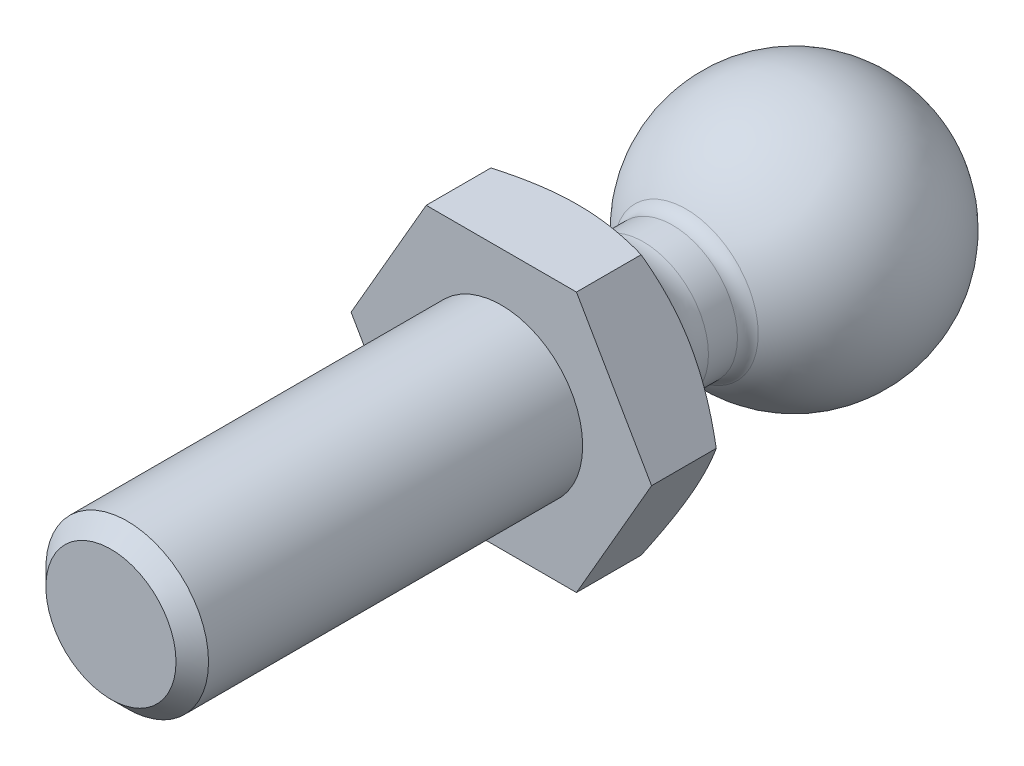
ISO-10303-21;
HEADER;
FILE_DESCRIPTION(('STEP AP214'),'2;1');
FILE_NAME('part.step','',(''),(''),'','','');
FILE_SCHEMA(('AUTOMOTIVE_DESIGN { 1 0 10303 214 1 1 1 1 }'));
ENDSEC;
DATA;
#1=APPLICATION_CONTEXT('core data for automotive mechanical design processes');
#2=APPLICATION_PROTOCOL_DEFINITION('international standard','automotive_design',2000,#1);
#3=PRODUCT_CONTEXT('',#1,'mechanical');
#4=PRODUCT('Part','Part','',(#3));
#5=PRODUCT_RELATED_PRODUCT_CATEGORY('part','',(#4));
#6=PRODUCT_DEFINITION_FORMATION('','',#4);
#7=PRODUCT_DEFINITION_CONTEXT('part definition',#1,'design');
#8=PRODUCT_DEFINITION('design','',#6,#7);
#9=PRODUCT_DEFINITION_SHAPE('','',#8);
#10=(LENGTH_UNIT() NAMED_UNIT(*) SI_UNIT(.MILLI.,.METRE.));
#11=(NAMED_UNIT(*) PLANE_ANGLE_UNIT() SI_UNIT($,.RADIAN.));
#12=(NAMED_UNIT(*) SI_UNIT($,.STERADIAN.) SOLID_ANGLE_UNIT());
#13=UNCERTAINTY_MEASURE_WITH_UNIT(LENGTH_MEASURE(1.E-05),#10,'distance_accuracy_value','');
#14=(GEOMETRIC_REPRESENTATION_CONTEXT(3) GLOBAL_UNCERTAINTY_ASSIGNED_CONTEXT((#13)) GLOBAL_UNIT_ASSIGNED_CONTEXT((#10,
#11,#12)) REPRESENTATION_CONTEXT('',''));
#15=CARTESIAN_POINT('',(0.,0.,0.));
#16=DIRECTION('',(0.,0.,1.));
#17=DIRECTION('',(1.,0.,0.));
#18=AXIS2_PLACEMENT_3D('',#15,#16,#17);
#19=CARTESIAN_POINT('',(6.9282032302755,4.,0.));
#20=DIRECTION('',(0.,0.,1.));
#21=DIRECTION('',(1.,0.,0.));
#22=AXIS2_PLACEMENT_3D('',#19,#20,#21);
#23=PLANE('',#22);
#24=DIRECTION('',(0.499999999999999,0.866025403784439,0.));
#25=VECTOR('',#24,1.);
#26=CARTESIAN_POINT('',(2.3094010767585,-4.00000000000001,0.));
#27=LINE('',#26,#25);
#28=CARTESIAN_POINT('',(2.3094010767585,-4.00000000000001,0.));
#29=VERTEX_POINT('',#28);
#30=CARTESIAN_POINT('',(4.61880215351701,0.,0.));
#31=VERTEX_POINT('',#30);
#32=EDGE_CURVE('E213',#29,#31,#27,.T.);
#33=ORIENTED_EDGE('',*,*,#32,.T.);
#34=DIRECTION('',(-0.5,0.866025403784439,0.));
#35=VECTOR('',#34,1.);
#36=CARTESIAN_POINT('',(4.61880215351701,0.,0.));
#37=LINE('',#36,#35);
#38=CARTESIAN_POINT('',(2.30940107675851,4.,0.));
#39=VERTEX_POINT('',#38);
#40=EDGE_CURVE('E372',#31,#39,#37,.T.);
#41=ORIENTED_EDGE('',*,*,#40,.T.);
#42=DIRECTION('',(-1.,0.,0.));
#43=VECTOR('',#42,1.);
#44=CARTESIAN_POINT('',(2.30940107675851,4.,0.));
#45=LINE('',#44,#43);
#46=CARTESIAN_POINT('',(-2.3094010767585,4.,0.));
#47=VERTEX_POINT('',#46);
#48=EDGE_CURVE('E375',#39,#47,#45,.T.);
#49=ORIENTED_EDGE('',*,*,#48,.T.);
#50=DIRECTION('',(-0.499999999999999,-0.866025403784439,0.));
#51=VECTOR('',#50,1.);
#52=CARTESIAN_POINT('',(-2.3094010767585,4.,0.));
#53=LINE('',#52,#51);
#54=CARTESIAN_POINT('',(-4.618802153517,0.,0.));
#55=VERTEX_POINT('',#54);
#56=EDGE_CURVE('E380',#47,#55,#53,.T.);
#57=ORIENTED_EDGE('',*,*,#56,.T.);
#58=DIRECTION('',(0.500000000000001,-0.866025403784438,0.));
#59=VECTOR('',#58,1.);
#60=CARTESIAN_POINT('',(-4.618802153517,0.,0.));
#61=LINE('',#60,#59);
#62=CARTESIAN_POINT('',(-2.30940107675849,-4.00000000000001,0.));
#63=VERTEX_POINT('',#62);
#64=EDGE_CURVE('E383',#55,#63,#61,.T.);
#65=ORIENTED_EDGE('',*,*,#64,.T.);
#66=DIRECTION('',(1.,0.,0.));
#67=VECTOR('',#66,1.);
#68=CARTESIAN_POINT('',(-2.30940107675849,-4.00000000000001,0.));
#69=LINE('',#68,#67);
#70=EDGE_CURVE('E374',#63,#29,#69,.T.);
#71=ORIENTED_EDGE('',*,*,#70,.T.);
#72=EDGE_LOOP('',(#33,#41,#49,#57,#65,#71));
#73=FACE_BOUND('',#72,.T.);
#74=CARTESIAN_POINT('',(0.,0.,0.));
#75=DIRECTION('',(0.,0.,1.));
#76=DIRECTION('',(1.,0.,0.));
#77=AXIS2_PLACEMENT_3D('',#74,#75,#76);
#78=CIRCLE('',#77,2.5);
#79=CARTESIAN_POINT('',(2.5,0.,0.));
#80=VERTEX_POINT('',#79);
#81=EDGE_CURVE('E216',#80,#80,#78,.T.);
#82=ORIENTED_EDGE('',*,*,#81,.F.);
#83=EDGE_LOOP('',(#82));
#84=FACE_BOUND('',#83,.T.);
#85=ADVANCED_FACE('F35',(#73,#84),#23,.T.);
#86=CARTESIAN_POINT('',(2.3094010767585,-4.00000000000001,-12.5));
#87=DIRECTION('',(0.866025403784439,-0.499999999999999,0.));
#88=DIRECTION('',(0.499999999999999,0.866025403784439,0.));
#89=AXIS2_PLACEMENT_3D('',#86,#87,#88);
#90=PLANE('',#89);
#91=DIRECTION('',(0.,0.,1.));
#92=VECTOR('',#91,1.);
#93=CARTESIAN_POINT('',(2.3094010767585,-4.00000000000001,-12.5));
#94=LINE('',#93,#92);
#95=CARTESIAN_POINT('',(2.3094010767585,-4.00000000000001,-1.9880338717126));
#96=VERTEX_POINT('',#95);
#97=EDGE_CURVE('E59',#96,#29,#94,.T.);
#98=ORIENTED_EDGE('',*,*,#97,.F.);
#99=CARTESIAN_POINT('',(2.30928560670467,-4.00020000000001,-1.987967202546));
#100=CARTESIAN_POINT('',(2.4107717464617,-3.82442084967678,-2.04658158797248));
#101=CARTESIAN_POINT('',(2.51313390883499,-3.64712438367363,-2.0998891401585));
#102=CARTESIAN_POINT('',(2.71963072479811,-3.2894614068243,-2.19293779087436));
#103=CARTESIAN_POINT('',(2.82376904741904,-3.10908854102986,-2.23264597259106));
#104=CARTESIAN_POINT('',(3.03075510011795,-2.75057818129722,-2.29445724634048));
#105=CARTESIAN_POINT('',(3.13357098372492,-2.57249584706487,-2.31697173009787));
#106=CARTESIAN_POINT('',(3.33968651028528,-2.2154932828335,-2.34384883847418));
#107=CARTESIAN_POINT('',(3.44298540411434,-2.03657435035591,-2.34823372019382));
#108=CARTESIAN_POINT('',(3.63600352522932,-1.70225715780327,-2.33910938868079));
#109=CARTESIAN_POINT('',(3.72575165335064,-1.54680884001294,-2.32784050763277));
#110=CARTESIAN_POINT('',(3.90466320392054,-1.23692494436495,-2.29212547082257));
#111=CARTESIAN_POINT('',(3.99382600759478,-1.08249043825587,-2.26766711590923));
#112=CARTESIAN_POINT('',(4.17310641015197,-0.771967672225426,-2.20652339670148));
#113=CARTESIAN_POINT('',(4.26320131938131,-0.615918711936901,-2.1695788579659));
#114=CARTESIAN_POINT('',(4.4420474282755,-0.306148164596163,-2.08572938907274));
#115=CARTESIAN_POINT('',(4.53080091904966,-0.152422609226222,-2.03884415940803));
#116=CARTESIAN_POINT('',(4.61891762357084,0.000199999999999598,-1.987967202546));
#117=B_SPLINE_CURVE_WITH_KNOTS('',3,(#99,#100,#101,#102,#103,#104,#105,#106,#107,#108,#109,#110,
#111,#112,#113,#114,#115,#116),.UNSPECIFIED.,.F.,.F.,(4,2,2,2,2,2,2,2,4),(0.,0.634047835695966,
1.26961969224543,1.88946157213122,2.50854226669297,3.04757825393386,3.58711366126904,
4.13861653143764,4.68903648037744),.UNSPECIFIED.);
#118=CARTESIAN_POINT('',(4.61880215351701,0.,-1.9880338717126));
#119=VERTEX_POINT('',#118);
#120=EDGE_CURVE('E177',#96,#119,#117,.T.);
#121=ORIENTED_EDGE('',*,*,#120,.T.);
#122=DIRECTION('',(0.,0.,1.));
#123=VECTOR('',#122,1.);
#124=CARTESIAN_POINT('',(4.61880215351701,0.,-12.5));
#125=LINE('',#124,#123);
#126=EDGE_CURVE('E135',#119,#31,#125,.T.);
#127=ORIENTED_EDGE('',*,*,#126,.T.);
#128=ORIENTED_EDGE('',*,*,#32,.F.);
#129=EDGE_LOOP('',(#98,#121,#127,#128));
#130=FACE_BOUND('',#129,.T.);
#131=ADVANCED_FACE('F37',(#130),#90,.T.);
#132=CARTESIAN_POINT('',(-2.30940107675849,-4.00000000000001,-12.5));
#133=DIRECTION('',(0.,-1.,0.));
#134=DIRECTION('',(0.,0.,-1.));
#135=AXIS2_PLACEMENT_3D('',#132,#133,#134);
#136=PLANE('',#135);
#137=DIRECTION('',(0.,0.,1.));
#138=VECTOR('',#137,1.);
#139=CARTESIAN_POINT('',(-2.30940107675849,-4.00000000000001,-12.5));
#140=LINE('',#139,#138);
#141=CARTESIAN_POINT('',(-2.30940107675849,-4.00000000000001,-1.9880338717126));
#142=VERTEX_POINT('',#141);
#143=EDGE_CURVE('E387',#142,#63,#140,.T.);
#144=ORIENTED_EDGE('',*,*,#143,.F.);
#145=CARTESIAN_POINT('',(-6.03774700031323,-4.00000000000001,-0.473217992686856));
#146=CARTESIAN_POINT('',(-5.8643277502091,-4.00000000000001,-0.556661808391503));
#147=CARTESIAN_POINT('',(-5.69049203979905,-4.00000000000001,-0.639255924910669));
#148=CARTESIAN_POINT('',(-5.3417654657578,-4.00000000000001,-0.802263064880815));
#149=CARTESIAN_POINT('',(-5.16687442427928,-4.00000000000001,-0.882675707401237));
#150=CARTESIAN_POINT('',(-4.81483182752291,-4.00000000000001,-1.04127887756491));
#151=CARTESIAN_POINT('',(-4.6376730148453,-4.00000000000001,-1.11945335580142));
#152=CARTESIAN_POINT('',(-4.28188657756566,-4.00000000000001,-1.27237243953788));
#153=CARTESIAN_POINT('',(-4.10325902831531,-4.00000000000001,-1.34711721971538));
#154=CARTESIAN_POINT('',(-3.73922796571441,-4.00000000000001,-1.49429630468268));
#155=CARTESIAN_POINT('',(-3.55377451953872,-4.00000000000001,-1.56660782087149));
#156=CARTESIAN_POINT('',(-3.1806378656117,-4.00000000000001,-1.70534594290675));
#157=CARTESIAN_POINT('',(-2.9929544022017,-4.00000000000001,-1.77177186647518));
#158=CARTESIAN_POINT('',(-2.61546735489355,-4.00000000000001,-1.8968729231541));
#159=CARTESIAN_POINT('',(-2.42566954456235,-4.00000000000001,-1.95556529267962));
#160=CARTESIAN_POINT('',(-2.04335904703302,-4.00000000000001,-2.06320833119629));
#161=CARTESIAN_POINT('',(-1.8508472881741,-4.00000000000001,-2.11216224872431));
#162=CARTESIAN_POINT('',(-1.46400141245824,-4.00000000000001,-2.19763148569086));
#163=CARTESIAN_POINT('',(-1.26968052349123,-4.00000000000001,-2.23420552946369));
#164=CARTESIAN_POINT('',(-0.878806898164011,-4.00000000000001,-2.29272762872542));
#165=CARTESIAN_POINT('',(-0.6822543237401,-4.00000000000001,-2.31467673862233));
#166=CARTESIAN_POINT('',(-0.290391329411559,-4.00000000000001,-2.34191038913072));
#167=CARTESIAN_POINT('',(-0.0950952282866528,-4.00000000000001,-2.34739595739391));
#168=CARTESIAN_POINT('',(0.295268603632837,-4.00000000000001,-2.34175731284425));
#169=CARTESIAN_POINT('',(0.490336323228053,-4.00000000000001,-2.33063231703376));
#170=CARTESIAN_POINT('',(0.826604199656073,-4.00000000000001,-2.29789488197838));
#171=CARTESIAN_POINT('',(0.968175397290224,-4.00000000000001,-2.27990988285591));
#172=CARTESIAN_POINT('',(1.25016360407163,-4.00000000000001,-2.23640492550423));
#173=CARTESIAN_POINT('',(1.39058043049095,-4.00000000000001,-2.21088379710212));
#174=CARTESIAN_POINT('',(1.80997660177634,-4.00000000000001,-2.12437062080881));
#175=CARTESIAN_POINT('',(2.08692403836564,-4.00000000000001,-2.05344823566865));
#176=CARTESIAN_POINT('',(2.50093044608734,-4.00000000000001,-1.93194868141056));
#177=CARTESIAN_POINT('',(2.64016747471344,-4.00000000000001,-1.88838302607421));
#178=CARTESIAN_POINT('',(2.91728758003159,-4.00000000000001,-1.79710166068086));
#179=CARTESIAN_POINT('',(3.05517064772364,-4.00000000000001,-1.74938592305832));
#180=CARTESIAN_POINT('',(3.32963467282167,-4.00000000000001,-1.65053861268695));
#181=CARTESIAN_POINT('',(3.46621611964452,-4.00000000000001,-1.59940838679047));
#182=CARTESIAN_POINT('',(3.73827246303557,-4.00000000000001,-1.49429600771276));
#183=CARTESIAN_POINT('',(3.87374737176306,-4.00000000000001,-1.44031388591861));
#184=CARTESIAN_POINT('',(4.19076095394552,-4.00000000000001,-1.31075461248524));
#185=CARTESIAN_POINT('',(4.37190219568479,-4.00000000000001,-1.23420682262475));
#186=CARTESIAN_POINT('',(4.73271642970179,-4.00000000000001,-1.07771660584016));
#187=CARTESIAN_POINT('',(4.9123893434326,-4.00000000000001,-0.997773998712483));
#188=CARTESIAN_POINT('',(5.27053821975977,-4.00000000000001,-0.835174851858108));
#189=CARTESIAN_POINT('',(5.44901396527703,-4.00000000000001,-0.752517835143919));
#190=CARTESIAN_POINT('',(5.80494205875227,-4.00000000000001,-0.585025946691388));
#191=CARTESIAN_POINT('',(5.98239438745108,-4.00000000000001,-0.500191034131008));
#192=CARTESIAN_POINT('',(6.51381471434333,-4.00000000000001,-0.242886420546202));
#193=CARTESIAN_POINT('',(6.86650278253039,-4.00000000000001,-0.0677747141179981));
#194=CARTESIAN_POINT('',(7.56941657177787,-4.00000000000001,0.287203008738353));
#195=CARTESIAN_POINT('',(7.9196425474664,-4.00000000000001,0.467068524093441));
#196=CARTESIAN_POINT('',(8.5898230897872,-4.00000000000001,0.815387249931764));
#197=CARTESIAN_POINT('',(8.90991621387701,-4.00000000000001,0.983574333556836));
#198=CARTESIAN_POINT('',(9.54896962459202,-4.00000000000001,1.32210769167413));
#199=CARTESIAN_POINT('',(9.8679298755912,-4.00000000000001,1.49245403331326));
#200=CARTESIAN_POINT('',(10.5042587606223,-4.00000000000001,1.83441635942938));
#201=CARTESIAN_POINT('',(10.8216293547442,-4.00000000000001,2.00602870097376));
#202=CARTESIAN_POINT('',(11.4556462153615,-4.00000000000001,2.35054996269615));
#203=CARTESIAN_POINT('',(11.7722925165003,-4.00000000000001,2.52345881909356));
#204=CARTESIAN_POINT('',(12.0886714972264,-4.00000000000001,2.69685209962065));
#205=B_SPLINE_CURVE_WITH_KNOTS('',3,(#145,#146,#147,#148,#149,#150,#151,#152,#153,#154,#155,
#156,#157,#158,#159,#160,#161,#162,#163,#164,#165,#166,#167,#168,#169,#170,#171,#172,#173,#174,
#175,#176,#177,#178,#179,#180,#181,#182,#183,#184,#185,#186,#187,#188,#189,#190,#191,#192,#193,
#194,#195,#196,#197,#198,#199,#200,#201,#202,#203,#204),.UNSPECIFIED.,.F.,.F.,(4,2,2,2,2,2,2,2,
2,2,2,2,2,2,2,2,2,2,2,2,2,2,2,2,2,2,2,2,2,4),(0.,0.577358737464175,1.15481765310774,
1.73570900015325,2.31657072897444,2.9136514249986,3.51080124634885,4.10659678757212,
4.70219324979446,5.29492353536233,5.88761108246669,6.47303157641777,7.05847966710464,
7.48639594950924,7.91437871160977,8.77087783984062,9.20852630612597,9.64617767956683,
10.0836574286787,10.5211323640238,11.1110394595363,11.7009779077145,12.2910205830002,
12.8810743260122,14.0623150769751,15.2434318124763,16.3281874884148,17.4129769803933,
18.495366388553,19.5777028946257),.UNSPECIFIED.);
#206=EDGE_CURVE('E172',#142,#96,#205,.T.);
#207=ORIENTED_EDGE('',*,*,#206,.T.);
#208=ORIENTED_EDGE('',*,*,#97,.T.);
#209=ORIENTED_EDGE('',*,*,#70,.F.);
#210=EDGE_LOOP('',(#144,#207,#208,#209));
#211=FACE_BOUND('',#210,.T.);
#212=ADVANCED_FACE('F182',(#211),#136,.T.);
#213=CARTESIAN_POINT('',(-4.618802153517,0.,-12.5));
#214=DIRECTION('',(-0.866025403784438,-0.500000000000001,0.));
#215=DIRECTION('',(0.500000000000001,-0.866025403784438,0.));
#216=AXIS2_PLACEMENT_3D('',#213,#214,#215);
#217=PLANE('',#216);
#218=DIRECTION('',(0.,0.,1.));
#219=VECTOR('',#218,1.);
#220=CARTESIAN_POINT('',(-4.618802153517,0.,-12.5));
#221=LINE('',#220,#219);
#222=CARTESIAN_POINT('',(-4.618802153517,0.,-1.98803387171261));
#223=VERTEX_POINT('',#222);
#224=EDGE_CURVE('E389',#223,#55,#221,.T.);
#225=ORIENTED_EDGE('',*,*,#224,.F.);
#226=CARTESIAN_POINT('',(-4.61891762357084,0.000199999999990338,-1.987967202546));
#227=CARTESIAN_POINT('',(-4.5174314838138,-0.175579150323237,-2.04658158797249));
#228=CARTESIAN_POINT('',(-4.41506932144051,-0.35287561632639,-2.09988914015851));
#229=CARTESIAN_POINT('',(-4.20857250547739,-0.710538593175715,-2.19293779087436));
#230=CARTESIAN_POINT('',(-4.10443418285646,-0.890911458970159,-2.23264597259106));
#231=CARTESIAN_POINT('',(-3.89744813015756,-1.2494218187028,-2.29445724634049));
#232=CARTESIAN_POINT('',(-3.79463224655059,-1.42750415293515,-2.31697173009788));
#233=CARTESIAN_POINT('',(-3.58851671999022,-1.78450671716652,-2.34384883847418));
#234=CARTESIAN_POINT('',(-3.48521782616117,-1.96342564964411,-2.34823372019382));
#235=CARTESIAN_POINT('',(-3.29219970504618,-2.29774284219674,-2.33910938868079));
#236=CARTESIAN_POINT('',(-3.20245157692486,-2.45319115998707,-2.32784050763277));
#237=CARTESIAN_POINT('',(-3.02354002635496,-2.76307505563506,-2.29212547082257));
#238=CARTESIAN_POINT('',(-2.93437722268072,-2.91750956174414,-2.26766711590923));
#239=CARTESIAN_POINT('',(-2.75509682012353,-3.22803232777459,-2.20652339670147));
#240=CARTESIAN_POINT('',(-2.66500191089419,-3.38408128806311,-2.1695788579659));
#241=CARTESIAN_POINT('',(-2.486155802,-3.69385183540385,-2.08572938907274));
#242=CARTESIAN_POINT('',(-2.39740231122584,-3.84757739077379,-2.03884415940802));
#243=CARTESIAN_POINT('',(-2.30928560670466,-4.00020000000001,-1.987967202546));
#244=B_SPLINE_CURVE_WITH_KNOTS('',3,(#226,#227,#228,#229,#230,#231,#232,#233,#234,#235,#236,
#237,#238,#239,#240,#241,#242,#243),.UNSPECIFIED.,.F.,.F.,(4,2,2,2,2,2,2,2,4),(0.,
0.634047835695965,1.26961969224543,1.88946157213122,2.50854226669297,3.04757825393385,
3.58711366126903,4.13861653143764,4.68903648037743),.UNSPECIFIED.);
#245=EDGE_CURVE('E166',#223,#142,#244,.T.);
#246=ORIENTED_EDGE('',*,*,#245,.T.);
#247=ORIENTED_EDGE('',*,*,#143,.T.);
#248=ORIENTED_EDGE('',*,*,#64,.F.);
#249=EDGE_LOOP('',(#225,#246,#247,#248));
#250=FACE_BOUND('',#249,.T.);
#251=ADVANCED_FACE('F185',(#250),#217,.T.);
#252=CARTESIAN_POINT('',(-2.3094010767585,4.,-12.5));
#253=DIRECTION('',(-0.866025403784439,0.499999999999999,0.));
#254=DIRECTION('',(-0.499999999999999,-0.866025403784439,0.));
#255=AXIS2_PLACEMENT_3D('',#252,#253,#254);
#256=PLANE('',#255);
#257=DIRECTION('',(0.,0.,1.));
#258=VECTOR('',#257,1.);
#259=CARTESIAN_POINT('',(-2.3094010767585,4.,-12.5));
#260=LINE('',#259,#258);
#261=CARTESIAN_POINT('',(-2.3094010767585,4.,-1.98803387171261));
#262=VERTEX_POINT('',#261);
#263=EDGE_CURVE('E391',#262,#47,#260,.T.);
#264=ORIENTED_EDGE('',*,*,#263,.F.);
#265=CARTESIAN_POINT('',(-2.30928560670466,4.0002,-1.987967202546));
#266=CARTESIAN_POINT('',(-2.4107717464617,3.82442084967677,-2.04658158797249));
#267=CARTESIAN_POINT('',(-2.51313390883499,3.64712438367362,-2.09988914015851));
#268=CARTESIAN_POINT('',(-2.71963072479811,3.28946140682429,-2.19293779087436));
#269=CARTESIAN_POINT('',(-2.82376904741904,3.10908854102985,-2.23264597259106));
#270=CARTESIAN_POINT('',(-3.03075510011795,2.75057818129721,-2.29445724634049));
#271=CARTESIAN_POINT('',(-3.13357098372491,2.57249584706486,-2.31697173009788));
#272=CARTESIAN_POINT('',(-3.33968651028528,2.21549328283349,-2.34384883847418));
#273=CARTESIAN_POINT('',(-3.44298540411433,2.0365743503559,-2.34823372019382));
#274=CARTESIAN_POINT('',(-3.63600352522932,1.70225715780327,-2.3391093886808));
#275=CARTESIAN_POINT('',(-3.72575165335064,1.54680884001293,-2.32784050763277));
#276=CARTESIAN_POINT('',(-3.90466320392054,1.23692494436494,-2.29212547082257));
#277=CARTESIAN_POINT('',(-3.99382600759478,1.08249043825587,-2.26766711590923));
#278=CARTESIAN_POINT('',(-4.17310641015197,0.771967672225416,-2.20652339670148));
#279=CARTESIAN_POINT('',(-4.26320131938131,0.615918711936891,-2.16957885796591));
#280=CARTESIAN_POINT('',(-4.4420474282755,0.306148164596152,-2.08572938907274));
#281=CARTESIAN_POINT('',(-4.53080091904966,0.152422609226212,-2.03884415940803));
#282=CARTESIAN_POINT('',(-4.61891762357084,-0.000200000000009566,-1.987967202546));
#283=B_SPLINE_CURVE_WITH_KNOTS('',3,(#265,#266,#267,#268,#269,#270,#271,#272,#273,#274,#275,
#276,#277,#278,#279,#280,#281,#282),.UNSPECIFIED.,.F.,.F.,(4,2,2,2,2,2,2,2,4),(0.,
0.634047835695964,1.26961969224543,1.88946157213122,2.50854226669296,3.04757825393385,
3.58711366126903,4.13861653143764,4.68903648037743),.UNSPECIFIED.);
#284=EDGE_CURVE('E128',#262,#223,#283,.T.);
#285=ORIENTED_EDGE('',*,*,#284,.T.);
#286=ORIENTED_EDGE('',*,*,#224,.T.);
#287=ORIENTED_EDGE('',*,*,#56,.F.);
#288=EDGE_LOOP('',(#264,#285,#286,#287));
#289=FACE_BOUND('',#288,.T.);
#290=ADVANCED_FACE('F189',(#289),#256,.T.);
#291=CARTESIAN_POINT('',(2.30940107675851,4.,-12.5));
#292=DIRECTION('',(0.,1.,0.));
#293=DIRECTION('',(0.,0.,1.));
#294=AXIS2_PLACEMENT_3D('',#291,#292,#293);
#295=PLANE('',#294);
#296=DIRECTION('',(0.,0.,1.));
#297=VECTOR('',#296,1.);
#298=CARTESIAN_POINT('',(2.30940107675851,4.,-12.5));
#299=LINE('',#298,#297);
#300=CARTESIAN_POINT('',(2.30940107675851,4.,-1.98803387171261));
#301=VERTEX_POINT('',#300);
#302=EDGE_CURVE('E392',#301,#39,#299,.T.);
#303=ORIENTED_EDGE('',*,*,#302,.F.);
#304=CARTESIAN_POINT('',(-6.03774700031323,4.,-0.473217992686864));
#305=CARTESIAN_POINT('',(-5.8643277502091,4.,-0.556661808391509));
#306=CARTESIAN_POINT('',(-5.69049203979904,4.,-0.639255924910675));
#307=CARTESIAN_POINT('',(-5.3417654657578,4.,-0.802263064880822));
#308=CARTESIAN_POINT('',(-5.16687442427928,4.,-0.882675707401244));
#309=CARTESIAN_POINT('',(-4.81483182752291,4.,-1.04127887756491));
#310=CARTESIAN_POINT('',(-4.6376730148453,4.,-1.11945335580143));
#311=CARTESIAN_POINT('',(-4.28188657756566,4.,-1.27237243953788));
#312=CARTESIAN_POINT('',(-4.10325902831531,4.,-1.34711721971538));
#313=CARTESIAN_POINT('',(-3.73922796571441,4.,-1.49429630468269));
#314=CARTESIAN_POINT('',(-3.55377451953873,4.,-1.56660782087149));
#315=CARTESIAN_POINT('',(-3.1806378656117,4.,-1.70534594290676));
#316=CARTESIAN_POINT('',(-2.99295440220171,4.,-1.77177186647519));
#317=CARTESIAN_POINT('',(-2.61546735489355,4.,-1.8968729231541));
#318=CARTESIAN_POINT('',(-2.42566954456235,4.,-1.95556529267963));
#319=CARTESIAN_POINT('',(-2.04335904703303,4.,-2.0632083311963));
#320=CARTESIAN_POINT('',(-1.85084728817411,4.,-2.11216224872431));
#321=CARTESIAN_POINT('',(-1.46400141245824,4.,-2.19763148569087));
#322=CARTESIAN_POINT('',(-1.26968052349124,4.,-2.23420552946369));
#323=CARTESIAN_POINT('',(-0.87880689816402,4.,-2.29272762872542));
#324=CARTESIAN_POINT('',(-0.68225432374011,4.,-2.31467673862233));
#325=CARTESIAN_POINT('',(-0.290391329411571,4.,-2.34191038913073));
#326=CARTESIAN_POINT('',(-0.0950952282866643,4.,-2.34739595739391));
#327=CARTESIAN_POINT('',(0.295268603632825,4.,-2.34175731284426));
#328=CARTESIAN_POINT('',(0.490336323228041,4.,-2.33063231703376));
#329=CARTESIAN_POINT('',(0.82660419965606,4.,-2.29789488197839));
#330=CARTESIAN_POINT('',(0.96817539729021,4.,-2.27990988285592));
#331=CARTESIAN_POINT('',(1.25016360407161,4.,-2.23640492550424));
#332=CARTESIAN_POINT('',(1.39058043049093,4.,-2.21088379710213));
#333=CARTESIAN_POINT('',(1.80997660177632,4.,-2.12437062080882));
#334=CARTESIAN_POINT('',(2.08692403836562,4.,-2.05344823566866));
#335=CARTESIAN_POINT('',(2.50093044608732,4.,-1.93194868141057));
#336=CARTESIAN_POINT('',(2.64016747471341,4.,-1.88838302607423));
#337=CARTESIAN_POINT('',(2.91728758003157,4.,-1.79710166068087));
#338=CARTESIAN_POINT('',(3.05517064772362,4.,-1.74938592305834));
#339=CARTESIAN_POINT('',(3.32963467282164,4.,-1.65053861268696));
#340=CARTESIAN_POINT('',(3.46621611964449,4.,-1.59940838679049));
#341=CARTESIAN_POINT('',(3.73827246303554,4.,-1.49429600771277));
#342=CARTESIAN_POINT('',(3.87374737176303,4.,-1.44031388591863));
#343=CARTESIAN_POINT('',(4.19076095394549,4.,-1.31075461248526));
#344=CARTESIAN_POINT('',(4.37190219568476,4.,-1.23420682262477));
#345=CARTESIAN_POINT('',(4.73271642970176,4.,-1.07771660584018));
#346=CARTESIAN_POINT('',(4.91238934343257,4.,-0.9977739987125));
#347=CARTESIAN_POINT('',(5.27053821975974,4.,-0.835174851858126));
#348=CARTESIAN_POINT('',(5.449013965277,4.,-0.752517835143937));
#349=CARTESIAN_POINT('',(5.80494205875225,4.,-0.585025946691404));
#350=CARTESIAN_POINT('',(5.98239438745105,4.,-0.500191034131025));
#351=CARTESIAN_POINT('',(6.51381471434331,4.,-0.242886420546217));
#352=CARTESIAN_POINT('',(6.86650278253037,4.,-0.0677747141180122));
#353=CARTESIAN_POINT('',(7.56941657177785,4.,0.28720300873834));
#354=CARTESIAN_POINT('',(7.91964254746638,4.,0.467068524093429));
#355=CARTESIAN_POINT('',(8.58982308978719,4.,0.815387249931753));
#356=CARTESIAN_POINT('',(8.909916213877,4.,0.983574333556824));
#357=CARTESIAN_POINT('',(9.548969624592,4.,1.32210769167412));
#358=CARTESIAN_POINT('',(9.86792987559119,4.,1.49245403331325));
#359=CARTESIAN_POINT('',(10.5042587606222,4.,1.83441635942937));
#360=CARTESIAN_POINT('',(10.8216293547442,4.,2.00602870097375));
#361=CARTESIAN_POINT('',(11.4556462153614,4.,2.35054996269614));
#362=CARTESIAN_POINT('',(11.7722925165003,4.,2.52345881909355));
#363=CARTESIAN_POINT('',(12.0886714972264,4.,2.69685209962064));
#364=B_SPLINE_CURVE_WITH_KNOTS('',3,(#304,#305,#306,#307,#308,#309,#310,#311,#312,#313,#314,
#315,#316,#317,#318,#319,#320,#321,#322,#323,#324,#325,#326,#327,#328,#329,#330,#331,#332,#333,
#334,#335,#336,#337,#338,#339,#340,#341,#342,#343,#344,#345,#346,#347,#348,#349,#350,#351,#352,
#353,#354,#355,#356,#357,#358,#359,#360,#361,#362,#363),.UNSPECIFIED.,.F.,.F.,(4,2,2,2,2,2,2,2,
2,2,2,2,2,2,2,2,2,2,2,2,2,2,2,2,2,2,2,2,2,4),(0.,0.577358737464173,1.15481765310773,
1.73570900015324,2.31657072897443,2.91365142499859,3.51080124634884,4.10659678757211,
4.70219324979444,5.29492353536232,5.88761108246667,6.47303157641776,7.05847966710462,
7.48639594950922,7.91437871160975,8.7708778398406,9.20852630612594,9.6461776795668,
10.0836574286787,10.5211323640238,11.1110394595362,11.7009779077145,12.2910205830002,
12.8810743260122,14.0623150769751,15.2434318124763,16.3281874884148,17.4129769803933,
18.495366388553,19.5777028946257),.UNSPECIFIED.);
#365=EDGE_CURVE('E51',#301,#262,#364,.F.);
#366=ORIENTED_EDGE('',*,*,#365,.T.);
#367=ORIENTED_EDGE('',*,*,#263,.T.);
#368=ORIENTED_EDGE('',*,*,#48,.F.);
#369=EDGE_LOOP('',(#303,#366,#367,#368));
#370=FACE_BOUND('',#369,.T.);
#371=ADVANCED_FACE('F193',(#370),#295,.T.);
#372=CARTESIAN_POINT('',(4.61880215351701,0.,-12.5));
#373=DIRECTION('',(0.866025403784439,0.5,0.));
#374=DIRECTION('',(-0.5,0.866025403784439,0.));
#375=AXIS2_PLACEMENT_3D('',#372,#373,#374);
#376=PLANE('',#375);
#377=ORIENTED_EDGE('',*,*,#126,.F.);
#378=CARTESIAN_POINT('',(4.61891762357084,-0.000199999999999787,-1.987967202546));
#379=CARTESIAN_POINT('',(4.51743148381381,0.175579150323228,-2.04658158797248));
#380=CARTESIAN_POINT('',(4.41506932144052,0.352875616326381,-2.0998891401585));
#381=CARTESIAN_POINT('',(4.20857250547739,0.710538593175706,-2.19293779087436));
#382=CARTESIAN_POINT('',(4.10443418285647,0.89091145897015,-2.23264597259106));
#383=CARTESIAN_POINT('',(3.89744813015756,1.24942181870279,-2.29445724634049));
#384=CARTESIAN_POINT('',(3.79463224655059,1.42750415293514,-2.31697173009788));
#385=CARTESIAN_POINT('',(3.58851671999023,1.78450671716651,-2.34384883847418));
#386=CARTESIAN_POINT('',(3.48521782616117,1.9634256496441,-2.34823372019382));
#387=CARTESIAN_POINT('',(3.29219970504619,2.29774284219673,-2.33910938868079));
#388=CARTESIAN_POINT('',(3.20245157692487,2.45319115998706,-2.32784050763277));
#389=CARTESIAN_POINT('',(3.02354002635497,2.76307505563505,-2.29212547082257));
#390=CARTESIAN_POINT('',(2.93437722268073,2.91750956174413,-2.26766711590923));
#391=CARTESIAN_POINT('',(2.75509682012354,3.22803232777458,-2.20652339670148));
#392=CARTESIAN_POINT('',(2.6650019108942,3.3840812880631,-2.1695788579659));
#393=CARTESIAN_POINT('',(2.48615580200001,3.69385183540384,-2.08572938907274));
#394=CARTESIAN_POINT('',(2.39740231122585,3.84757739077378,-2.03884415940803));
#395=CARTESIAN_POINT('',(2.30928560670467,4.0002,-1.987967202546));
#396=B_SPLINE_CURVE_WITH_KNOTS('',3,(#378,#379,#380,#381,#382,#383,#384,#385,#386,#387,#388,
#389,#390,#391,#392,#393,#394,#395),.UNSPECIFIED.,.F.,.F.,(4,2,2,2,2,2,2,2,4),(0.,
0.634047835695965,1.26961969224543,1.88946157213122,2.50854226669297,3.04757825393385,
3.58711366126903,4.13861653143763,4.68903648037742),.UNSPECIFIED.);
#397=EDGE_CURVE('E137',#119,#301,#396,.T.);
#398=ORIENTED_EDGE('',*,*,#397,.T.);
#399=ORIENTED_EDGE('',*,*,#302,.T.);
#400=ORIENTED_EDGE('',*,*,#40,.F.);
#401=EDGE_LOOP('',(#377,#398,#399,#400));
#402=FACE_BOUND('',#401,.T.);
#403=ADVANCED_FACE('F111',(#402),#376,.T.);
#404=CARTESIAN_POINT('',(0.,0.,-9.));
#405=DIRECTION('',(0.,0.,1.));
#406=DIRECTION('',(0.,1.,0.));
#407=AXIS2_PLACEMENT_3D('',#404,#405,#406);
#408=SPHERICAL_SURFACE('',#407,4.);
#409=CARTESIAN_POINT('',(3.46410161513776,-2.,-9.));
#410=VERTEX_POINT('',#409);
#411=VERTEX_LOOP('',#410);
#412=FACE_BOUND('',#411,.T.);
#413=CARTESIAN_POINT('',(0.,-4.,-9.));
#414=VERTEX_POINT('',#413);
#415=VERTEX_LOOP('',#414);
#416=FACE_BOUND('',#415,.T.);
#417=CARTESIAN_POINT('',(-3.46410161513775,-2.,-9.));
#418=VERTEX_POINT('',#417);
#419=VERTEX_LOOP('',#418);
#420=FACE_BOUND('',#419,.T.);
#421=CARTESIAN_POINT('',(-3.46410161513776,2.,-9.));
#422=VERTEX_POINT('',#421);
#423=VERTEX_LOOP('',#422);
#424=FACE_BOUND('',#423,.T.);
#425=CARTESIAN_POINT('',(0.,4.,-9.));
#426=VERTEX_POINT('',#425);
#427=VERTEX_LOOP('',#426);
#428=FACE_BOUND('',#427,.T.);
#429=CARTESIAN_POINT('',(3.46410161513776,2.,-9.));
#430=VERTEX_POINT('',#429);
#431=VERTEX_LOOP('',#430);
#432=FACE_BOUND('',#431,.T.);
#433=CARTESIAN_POINT('',(0.,0.,-5.67408232286761));
#434=DIRECTION('',(0.,0.,1.));
#435=DIRECTION('',(1.,0.,0.));
#436=AXIS2_PLACEMENT_3D('',#433,#434,#435);
#437=CIRCLE('',#436,2.22222222222222);
#438=CARTESIAN_POINT('',(2.22222222222222,0.,-5.67408232286761));
#439=VERTEX_POINT('',#438);
#440=EDGE_CURVE('E117',#439,#439,#437,.T.);
#441=ORIENTED_EDGE('',*,*,#440,.F.);
#442=EDGE_LOOP('',(#441));
#443=FACE_BOUND('',#442,.T.);
#444=CARTESIAN_POINT('',(0.,0.,-12.5));
#445=DIRECTION('',(0.,0.,1.));
#446=DIRECTION('',(1.,0.,0.));
#447=AXIS2_PLACEMENT_3D('',#444,#445,#446);
#448=CIRCLE('',#447,1.93649167310371);
#449=CARTESIAN_POINT('',(1.93649167310371,0.,-12.5));
#450=VERTEX_POINT('',#449);
#451=EDGE_CURVE('E120',#450,#450,#448,.T.);
#452=ORIENTED_EDGE('',*,*,#451,.T.);
#453=EDGE_LOOP('',(#452));
#454=FACE_BOUND('',#453,.T.);
#455=ADVANCED_FACE('F107',(#412,#416,#420,#424,#428,#432,#443,#454),#408,.T.);
#456=CARTESIAN_POINT('',(0.,0.,-1.89762426157044));
#457=DIRECTION('',(0.,0.,1.));
#458=DIRECTION('',(1.,0.,0.));
#459=AXIS2_PLACEMENT_3D('',#456,#457,#458);
#460=CONICAL_SURFACE('',#459,4.77539619177573,1.0471975511966);
#461=ORIENTED_EDGE('',*,*,#206,.F.);
#462=ORIENTED_EDGE('',*,*,#245,.F.);
#463=ORIENTED_EDGE('',*,*,#284,.F.);
#464=ORIENTED_EDGE('',*,*,#365,.F.);
#465=ORIENTED_EDGE('',*,*,#397,.F.);
#466=ORIENTED_EDGE('',*,*,#120,.F.);
#467=EDGE_LOOP('',(#461,#462,#463,#464,#465,#466));
#468=FACE_BOUND('',#467,.T.);
#469=CARTESIAN_POINT('',(0.,0.,-3.06698729810778));
#470=DIRECTION('',(0.,0.,1.));
#471=DIRECTION('',(1.,0.,0.));
#472=AXIS2_PLACEMENT_3D('',#469,#470,#471);
#473=CIRCLE('',#472,2.75000000000001);
#474=CARTESIAN_POINT('',(2.75000000000001,0.,-3.06698729810778));
#475=VERTEX_POINT('',#474);
#476=EDGE_CURVE('E123',#475,#475,#473,.T.);
#477=ORIENTED_EDGE('',*,*,#476,.T.);
#478=EDGE_LOOP('',(#477));
#479=FACE_BOUND('',#478,.T.);
#480=ADVANCED_FACE('F110',(#468,#479),#460,.T.);
#481=CARTESIAN_POINT('',(0.,0.,-4.36602540378445));
#482=DIRECTION('',(0.,0.,1.));
#483=DIRECTION('',(1.,0.,0.));
#484=AXIS2_PLACEMENT_3D('',#481,#482,#483);
#485=TOROIDAL_SURFACE('',#484,3.5,1.5);
#486=CARTESIAN_POINT('',(0.,0.,-4.36602540378445));
#487=DIRECTION('',(0.,0.,1.));
#488=DIRECTION('',(1.,0.,0.));
#489=AXIS2_PLACEMENT_3D('',#486,#487,#488);
#490=CIRCLE('',#489,2.);
#491=CARTESIAN_POINT('',(2.,0.,-4.36602540378445));
#492=VERTEX_POINT('',#491);
#493=EDGE_CURVE('E131',#492,#492,#490,.T.);
#494=ORIENTED_EDGE('',*,*,#493,.T.);
#495=EDGE_LOOP('',(#494));
#496=FACE_BOUND('',#495,.T.);
#497=ORIENTED_EDGE('',*,*,#476,.F.);
#498=EDGE_LOOP('',(#497));
#499=FACE_BOUND('',#498,.T.);
#500=ADVANCED_FACE('F148',(#496,#499),#485,.F.);
#501=CARTESIAN_POINT('',(0.,0.,0.460032817627755));
#502=DIRECTION('',(0.,0.,1.));
#503=DIRECTION('',(1.,0.,0.));
#504=AXIS2_PLACEMENT_3D('',#501,#502,#503);
#505=CYLINDRICAL_SURFACE('',#504,2.);
#506=CARTESIAN_POINT('',(0.,0.,-5.25834261322606));
#507=DIRECTION('',(0.,0.,1.));
#508=DIRECTION('',(1.,0.,0.));
#509=AXIS2_PLACEMENT_3D('',#506,#507,#508);
#510=CIRCLE('',#509,2.);
#511=CARTESIAN_POINT('',(2.,0.,-5.25834261322606));
#512=VERTEX_POINT('',#511);
#513=EDGE_CURVE('E219',#512,#512,#510,.T.);
#514=ORIENTED_EDGE('',*,*,#513,.T.);
#515=EDGE_LOOP('',(#514));
#516=FACE_BOUND('',#515,.T.);
#517=ORIENTED_EDGE('',*,*,#493,.F.);
#518=EDGE_LOOP('',(#517));
#519=FACE_BOUND('',#518,.T.);
#520=ADVANCED_FACE('F229',(#516,#519),#505,.T.);
#521=CARTESIAN_POINT('',(0.,0.,-5.25834261322606));
#522=DIRECTION('',(0.,0.,1.));
#523=DIRECTION('',(1.,0.,0.));
#524=AXIS2_PLACEMENT_3D('',#521,#522,#523);
#525=TOROIDAL_SURFACE('',#524,2.5,0.5);
#526=ORIENTED_EDGE('',*,*,#440,.T.);
#527=EDGE_LOOP('',(#526));
#528=FACE_BOUND('',#527,.T.);
#529=ORIENTED_EDGE('',*,*,#513,.F.);
#530=EDGE_LOOP('',(#529));
#531=FACE_BOUND('',#530,.T.);
#532=ADVANCED_FACE('F231',(#528,#531),#525,.F.);
#533=CARTESIAN_POINT('',(6.9282032302755,4.,-12.5));
#534=DIRECTION('',(0.,0.,1.));
#535=DIRECTION('',(1.,0.,0.));
#536=AXIS2_PLACEMENT_3D('',#533,#534,#535);
#537=PLANE('',#536);
#538=ORIENTED_EDGE('',*,*,#451,.F.);
#539=EDGE_LOOP('',(#538));
#540=FACE_BOUND('',#539,.T.);
#541=ADVANCED_FACE('F186',(#540),#537,.F.);
#542=CARTESIAN_POINT('',(0.,0.,12.));
#543=DIRECTION('',(0.,0.,-1.));
#544=DIRECTION('',(-1.,0.,0.));
#545=AXIS2_PLACEMENT_3D('',#542,#543,#544);
#546=CYLINDRICAL_SURFACE('',#545,2.5);
#547=CARTESIAN_POINT('',(0.,0.,11.5));
#548=DIRECTION('',(0.,0.,1.));
#549=DIRECTION('',(1.,0.,0.));
#550=AXIS2_PLACEMENT_3D('',#547,#548,#549);
#551=CIRCLE('',#550,2.5);
#552=CARTESIAN_POINT('',(2.5,0.,11.5));
#553=VERTEX_POINT('',#552);
#554=EDGE_CURVE('E11',#553,#553,#551,.F.);
#555=ORIENTED_EDGE('',*,*,#554,.T.);
#556=EDGE_LOOP('',(#555));
#557=FACE_BOUND('',#556,.T.);
#558=ORIENTED_EDGE('',*,*,#81,.T.);
#559=EDGE_LOOP('',(#558));
#560=FACE_BOUND('',#559,.T.);
#561=ADVANCED_FACE('F240',(#557,#560),#546,.T.);
#562=CARTESIAN_POINT('',(0.,0.,12.));
#563=DIRECTION('',(0.,0.,1.));
#564=DIRECTION('',(1.,0.,0.));
#565=AXIS2_PLACEMENT_3D('',#562,#563,#564);
#566=PLANE('',#565);
#567=CARTESIAN_POINT('',(0.,0.,12.));
#568=DIRECTION('',(0.,0.,1.));
#569=DIRECTION('',(1.,0.,0.));
#570=AXIS2_PLACEMENT_3D('',#567,#568,#569);
#571=CIRCLE('',#570,2.);
#572=CARTESIAN_POINT('',(2.,0.,12.));
#573=VERTEX_POINT('',#572);
#574=EDGE_CURVE('E44',#573,#573,#571,.T.);
#575=ORIENTED_EDGE('',*,*,#574,.T.);
#576=EDGE_LOOP('',(#575));
#577=FACE_BOUND('',#576,.T.);
#578=ADVANCED_FACE('F243',(#577),#566,.T.);
#579=CARTESIAN_POINT('',(0.,0.,12.));
#580=DIRECTION('',(0.,0.,-1.));
#581=DIRECTION('',(-1.,0.,0.));
#582=AXIS2_PLACEMENT_3D('',#579,#580,#581);
#583=CONICAL_SURFACE('',#582,2.,0.785398163397445);
#584=ORIENTED_EDGE('',*,*,#554,.F.);
#585=EDGE_LOOP('',(#584));
#586=FACE_BOUND('',#585,.T.);
#587=ORIENTED_EDGE('',*,*,#574,.F.);
#588=EDGE_LOOP('',(#587));
#589=FACE_BOUND('',#588,.T.);
#590=ADVANCED_FACE('F247',(#586,#589),#583,.T.);
#591=CLOSED_SHELL('',(#85,#131,#212,#251,#290,#371,#403,#455,#480,#500,#520,#532,#541,#561,#578,#590));
#592=MANIFOLD_SOLID_BREP('B2',#591);
#593=ADVANCED_BREP_SHAPE_REPRESENTATION('',(#18,#592),#14);
#594=SHAPE_DEFINITION_REPRESENTATION(#9,#593);
ENDSEC;
END-ISO-10303-21;
